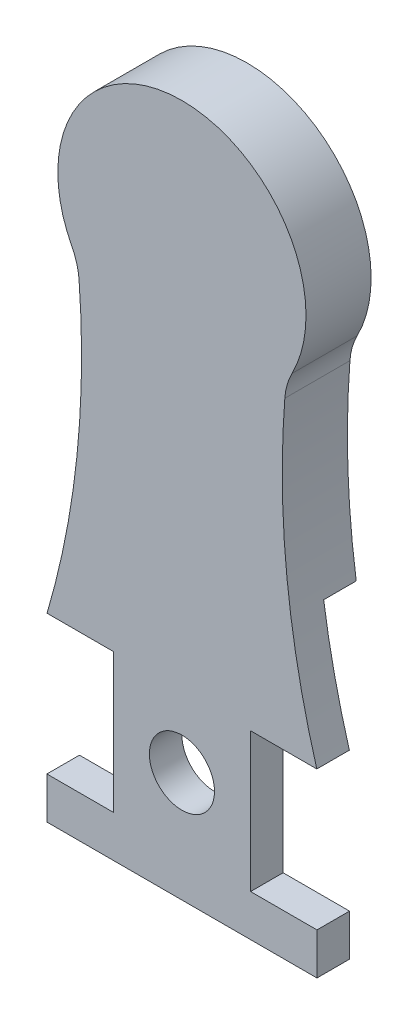
ISO-10303-21;
HEADER;
FILE_DESCRIPTION(('STEP AP214'),'2;1');
FILE_NAME('part.step','',(''),(''),'','','');
FILE_SCHEMA(('AUTOMOTIVE_DESIGN { 1 0 10303 214 1 1 1 1 }'));
ENDSEC;
DATA;
#1=APPLICATION_CONTEXT('core data for automotive mechanical design processes');
#2=APPLICATION_PROTOCOL_DEFINITION('international standard','automotive_design',2000,#1);
#3=PRODUCT_CONTEXT('',#1,'mechanical');
#4=PRODUCT('Part','Part','',(#3));
#5=PRODUCT_RELATED_PRODUCT_CATEGORY('part','',(#4));
#6=PRODUCT_DEFINITION_FORMATION('','',#4);
#7=PRODUCT_DEFINITION_CONTEXT('part definition',#1,'design');
#8=PRODUCT_DEFINITION('design','',#6,#7);
#9=PRODUCT_DEFINITION_SHAPE('','',#8);
#10=(LENGTH_UNIT() NAMED_UNIT(*) SI_UNIT(.MILLI.,.METRE.));
#11=(NAMED_UNIT(*) PLANE_ANGLE_UNIT() SI_UNIT($,.RADIAN.));
#12=(NAMED_UNIT(*) SI_UNIT($,.STERADIAN.) SOLID_ANGLE_UNIT());
#13=UNCERTAINTY_MEASURE_WITH_UNIT(LENGTH_MEASURE(1.E-05),#10,'distance_accuracy_value','');
#14=(GEOMETRIC_REPRESENTATION_CONTEXT(3) GLOBAL_UNCERTAINTY_ASSIGNED_CONTEXT((#13)) GLOBAL_UNIT_ASSIGNED_CONTEXT((#10,
#11,#12)) REPRESENTATION_CONTEXT('',''));
#15=CARTESIAN_POINT('',(0.,0.,0.));
#16=DIRECTION('',(0.,0.,1.));
#17=DIRECTION('',(1.,0.,0.));
#18=AXIS2_PLACEMENT_3D('',#15,#16,#17);
#19=CARTESIAN_POINT('',(0.,0.,0.));
#20=DIRECTION('',(0.,0.,1.));
#21=DIRECTION('',(1.,0.,0.));
#22=AXIS2_PLACEMENT_3D('',#19,#20,#21);
#23=CYLINDRICAL_SURFACE('',#22,5.);
#24=CARTESIAN_POINT('',(0.,0.,10.));
#25=DIRECTION('',(0.,0.,1.));
#26=DIRECTION('',(1.,0.,0.));
#27=AXIS2_PLACEMENT_3D('',#24,#25,#26);
#28=CIRCLE('',#27,5.);
#29=CARTESIAN_POINT('',(5.,0.,10.));
#30=VERTEX_POINT('',#29);
#31=EDGE_CURVE('E183',#30,#30,#28,.T.);
#32=ORIENTED_EDGE('',*,*,#31,.T.);
#33=EDGE_LOOP('',(#32));
#34=FACE_BOUND('',#33,.T.);
#35=CARTESIAN_POINT('',(0.,0.,5.));
#36=DIRECTION('',(0.,0.,-1.));
#37=DIRECTION('',(-1.,0.,0.));
#38=AXIS2_PLACEMENT_3D('',#35,#36,#37);
#39=CIRCLE('',#38,5.);
#40=CARTESIAN_POINT('',(-5.,0.,5.));
#41=VERTEX_POINT('',#40);
#42=EDGE_CURVE('E232',#41,#41,#39,.F.);
#43=ORIENTED_EDGE('',*,*,#42,.F.);
#44=EDGE_LOOP('',(#43));
#45=FACE_BOUND('',#44,.T.);
#46=ADVANCED_FACE('F32',(#34,#45),#23,.F.);
#47=CARTESIAN_POINT('',(-20.9931970741549,10.845815,0.));
#48=DIRECTION('',(0.,1.,0.));
#49=DIRECTION('',(0.,0.,1.));
#50=AXIS2_PLACEMENT_3D('',#47,#48,#49);
#51=PLANE('',#50);
#52=DIRECTION('',(-1.,0.,0.));
#53=VECTOR('',#52,1.);
#54=CARTESIAN_POINT('',(-20.9931970741549,10.845815,5.));
#55=LINE('',#54,#53);
#56=CARTESIAN_POINT('',(-10.542895,10.845815,5.));
#57=VERTEX_POINT('',#56);
#58=CARTESIAN_POINT('',(-20.7164128775921,10.845815,5.));
#59=VERTEX_POINT('',#58);
#60=EDGE_CURVE('E300',#57,#59,#55,.T.);
#61=ORIENTED_EDGE('',*,*,#60,.F.);
#62=DIRECTION('',(0.,0.,1.));
#63=VECTOR('',#62,1.);
#64=CARTESIAN_POINT('',(-10.542895,10.845815,0.));
#65=LINE('',#64,#63);
#66=CARTESIAN_POINT('',(-10.542895,10.845815,10.));
#67=VERTEX_POINT('',#66);
#68=EDGE_CURVE('E180',#57,#67,#65,.T.);
#69=ORIENTED_EDGE('',*,*,#68,.T.);
#70=DIRECTION('',(-1.,0.,0.));
#71=VECTOR('',#70,1.);
#72=CARTESIAN_POINT('',(-20.9931970741549,10.845815,10.));
#73=LINE('',#72,#71);
#74=CARTESIAN_POINT('',(-20.7164128775921,10.845815,10.));
#75=VERTEX_POINT('',#74);
#76=EDGE_CURVE('E172',#67,#75,#73,.T.);
#77=ORIENTED_EDGE('',*,*,#76,.T.);
#78=DIRECTION('',(0.,0.,-1.));
#79=VECTOR('',#78,1.);
#80=CARTESIAN_POINT('',(-20.7164128775921,10.845815,10.));
#81=LINE('',#80,#79);
#82=EDGE_CURVE('E179',#59,#75,#81,.F.);
#83=ORIENTED_EDGE('',*,*,#82,.F.);
#84=EDGE_LOOP('',(#61,#69,#77,#83));
#85=FACE_BOUND('',#84,.T.);
#86=ADVANCED_FACE('F323',(#85),#51,.F.);
#87=CARTESIAN_POINT('',(10.542895,10.845815,0.));
#88=DIRECTION('',(0.,1.,0.));
#89=DIRECTION('',(-1.,0.,0.));
#90=AXIS2_PLACEMENT_3D('',#87,#88,#89);
#91=PLANE('',#90);
#92=DIRECTION('',(-1.,0.,0.));
#93=VECTOR('',#92,1.);
#94=CARTESIAN_POINT('',(10.542895,10.845815,5.));
#95=LINE('',#94,#93);
#96=CARTESIAN_POINT('',(20.7164128775922,10.845815,5.));
#97=VERTEX_POINT('',#96);
#98=CARTESIAN_POINT('',(10.542895,10.845815,5.));
#99=VERTEX_POINT('',#98);
#100=EDGE_CURVE('E150',#97,#99,#95,.T.);
#101=ORIENTED_EDGE('',*,*,#100,.F.);
#102=DIRECTION('',(0.,0.,-1.));
#103=VECTOR('',#102,1.);
#104=CARTESIAN_POINT('',(20.7164128775922,10.845815,10.));
#105=LINE('',#104,#103);
#106=CARTESIAN_POINT('',(20.7164128775922,10.845815,10.));
#107=VERTEX_POINT('',#106);
#108=EDGE_CURVE('E176',#107,#97,#105,.T.);
#109=ORIENTED_EDGE('',*,*,#108,.F.);
#110=DIRECTION('',(-1.,0.,0.));
#111=VECTOR('',#110,1.);
#112=CARTESIAN_POINT('',(10.542895,10.845815,10.));
#113=LINE('',#112,#111);
#114=CARTESIAN_POINT('',(10.542895,10.845815,10.));
#115=VERTEX_POINT('',#114);
#116=EDGE_CURVE('E243',#107,#115,#113,.T.);
#117=ORIENTED_EDGE('',*,*,#116,.T.);
#118=DIRECTION('',(0.,0.,1.));
#119=VECTOR('',#118,1.);
#120=CARTESIAN_POINT('',(10.542895,10.845815,0.));
#121=LINE('',#120,#119);
#122=EDGE_CURVE('E168',#99,#115,#121,.T.);
#123=ORIENTED_EDGE('',*,*,#122,.F.);
#124=EDGE_LOOP('',(#101,#109,#117,#123));
#125=FACE_BOUND('',#124,.T.);
#126=ADVANCED_FACE('F311',(#125),#91,.F.);
#127=CARTESIAN_POINT('',(-10.542895,10.845815,0.));
#128=DIRECTION('',(1.,0.,0.));
#129=DIRECTION('',(0.,1.,0.));
#130=AXIS2_PLACEMENT_3D('',#127,#128,#129);
#131=PLANE('',#130);
#132=DIRECTION('',(0.,1.,0.));
#133=VECTOR('',#132,1.);
#134=CARTESIAN_POINT('',(-10.542895,10.845815,5.));
#135=LINE('',#134,#133);
#136=CARTESIAN_POINT('',(-10.542895,-10.5428949999999,5.));
#137=VERTEX_POINT('',#136);
#138=EDGE_CURVE('E295',#137,#57,#135,.T.);
#139=ORIENTED_EDGE('',*,*,#138,.F.);
#140=DIRECTION('',(0.,0.,1.));
#141=VECTOR('',#140,1.);
#142=CARTESIAN_POINT('',(-10.542895,-10.5428949999999,0.));
#143=LINE('',#142,#141);
#144=CARTESIAN_POINT('',(-10.542895,-10.5428949999999,10.));
#145=VERTEX_POINT('',#144);
#146=EDGE_CURVE('E267',#137,#145,#143,.T.);
#147=ORIENTED_EDGE('',*,*,#146,.T.);
#148=DIRECTION('',(0.,1.,0.));
#149=VECTOR('',#148,1.);
#150=CARTESIAN_POINT('',(-10.542895,10.845815,10.));
#151=LINE('',#150,#149);
#152=EDGE_CURVE('E261',#145,#67,#151,.T.);
#153=ORIENTED_EDGE('',*,*,#152,.T.);
#154=ORIENTED_EDGE('',*,*,#68,.F.);
#155=EDGE_LOOP('',(#139,#147,#153,#154));
#156=FACE_BOUND('',#155,.T.);
#157=ADVANCED_FACE('F363',(#156),#131,.F.);
#158=CARTESIAN_POINT('',(-10.542895,-10.5428949999999,0.));
#159=DIRECTION('',(0.,-1.,0.));
#160=DIRECTION('',(0.,0.,-1.));
#161=AXIS2_PLACEMENT_3D('',#158,#159,#160);
#162=PLANE('',#161);
#163=DIRECTION('',(1.,0.,0.));
#164=VECTOR('',#163,1.);
#165=CARTESIAN_POINT('',(-10.542895,-10.5428949999999,5.));
#166=LINE('',#165,#164);
#167=CARTESIAN_POINT('',(-20.741205,-10.5428949999999,5.));
#168=VERTEX_POINT('',#167);
#169=EDGE_CURVE('E293',#168,#137,#166,.T.);
#170=ORIENTED_EDGE('',*,*,#169,.F.);
#171=DIRECTION('',(0.,0.,1.));
#172=VECTOR('',#171,1.);
#173=CARTESIAN_POINT('',(-20.741205,-10.5428949999999,0.));
#174=LINE('',#173,#172);
#175=CARTESIAN_POINT('',(-20.741205,-10.5428949999999,10.));
#176=VERTEX_POINT('',#175);
#177=EDGE_CURVE('E269',#168,#176,#174,.T.);
#178=ORIENTED_EDGE('',*,*,#177,.T.);
#179=DIRECTION('',(1.,0.,0.));
#180=VECTOR('',#179,1.);
#181=CARTESIAN_POINT('',(-10.542895,-10.5428949999999,10.));
#182=LINE('',#181,#180);
#183=EDGE_CURVE('E258',#176,#145,#182,.T.);
#184=ORIENTED_EDGE('',*,*,#183,.T.);
#185=ORIENTED_EDGE('',*,*,#146,.F.);
#186=EDGE_LOOP('',(#170,#178,#184,#185));
#187=FACE_BOUND('',#186,.T.);
#188=ADVANCED_FACE('F360',(#187),#162,.F.);
#189=CARTESIAN_POINT('',(-20.741205,-10.5428949999999,0.));
#190=DIRECTION('',(1.,0.,0.));
#191=DIRECTION('',(0.,1.,0.));
#192=AXIS2_PLACEMENT_3D('',#189,#190,#191);
#193=PLANE('',#192);
#194=DIRECTION('',(0.,1.,0.));
#195=VECTOR('',#194,1.);
#196=CARTESIAN_POINT('',(-20.741205,-10.5428949999999,5.));
#197=LINE('',#196,#195);
#198=CARTESIAN_POINT('',(-20.741205,-16.942445,5.));
#199=VERTEX_POINT('',#198);
#200=EDGE_CURVE('E291',#199,#168,#197,.T.);
#201=ORIENTED_EDGE('',*,*,#200,.F.);
#202=DIRECTION('',(0.,0.,1.));
#203=VECTOR('',#202,1.);
#204=CARTESIAN_POINT('',(-20.741205,-16.942445,0.));
#205=LINE('',#204,#203);
#206=CARTESIAN_POINT('',(-20.741205,-16.942445,10.));
#207=VERTEX_POINT('',#206);
#208=EDGE_CURVE('E271',#199,#207,#205,.T.);
#209=ORIENTED_EDGE('',*,*,#208,.T.);
#210=DIRECTION('',(0.,1.,0.));
#211=VECTOR('',#210,1.);
#212=CARTESIAN_POINT('',(-20.741205,-10.5428949999999,10.));
#213=LINE('',#212,#211);
#214=EDGE_CURVE('E255',#207,#176,#213,.T.);
#215=ORIENTED_EDGE('',*,*,#214,.T.);
#216=ORIENTED_EDGE('',*,*,#177,.F.);
#217=EDGE_LOOP('',(#201,#209,#215,#216));
#218=FACE_BOUND('',#217,.T.);
#219=ADVANCED_FACE('F290',(#218),#193,.F.);
#220=CARTESIAN_POINT('',(-20.741205,-16.942445,0.));
#221=DIRECTION('',(0.,1.,0.));
#222=DIRECTION('',(-1.,0.,0.));
#223=AXIS2_PLACEMENT_3D('',#220,#221,#222);
#224=PLANE('',#223);
#225=DIRECTION('',(-1.,0.,0.));
#226=VECTOR('',#225,1.);
#227=CARTESIAN_POINT('',(-20.741205,-16.942445,5.));
#228=LINE('',#227,#226);
#229=CARTESIAN_POINT('',(20.741205,-16.9424449999999,5.));
#230=VERTEX_POINT('',#229);
#231=EDGE_CURVE('E279',#230,#199,#228,.T.);
#232=ORIENTED_EDGE('',*,*,#231,.F.);
#233=DIRECTION('',(0.,0.,1.));
#234=VECTOR('',#233,1.);
#235=CARTESIAN_POINT('',(20.741205,-16.9424449999999,0.));
#236=LINE('',#235,#234);
#237=CARTESIAN_POINT('',(20.741205,-16.9424449999999,10.));
#238=VERTEX_POINT('',#237);
#239=EDGE_CURVE('E170',#230,#238,#236,.T.);
#240=ORIENTED_EDGE('',*,*,#239,.T.);
#241=DIRECTION('',(-1.,0.,0.));
#242=VECTOR('',#241,1.);
#243=CARTESIAN_POINT('',(-20.741205,-16.942445,10.));
#244=LINE('',#243,#242);
#245=EDGE_CURVE('E252',#238,#207,#244,.T.);
#246=ORIENTED_EDGE('',*,*,#245,.T.);
#247=ORIENTED_EDGE('',*,*,#208,.F.);
#248=EDGE_LOOP('',(#232,#240,#246,#247));
#249=FACE_BOUND('',#248,.T.);
#250=ADVANCED_FACE('F275',(#249),#224,.F.);
#251=CARTESIAN_POINT('',(20.741205,-16.9424449999999,0.));
#252=DIRECTION('',(-1.,0.,0.));
#253=DIRECTION('',(0.,-1.,0.));
#254=AXIS2_PLACEMENT_3D('',#251,#252,#253);
#255=PLANE('',#254);
#256=DIRECTION('',(0.,-1.,0.));
#257=VECTOR('',#256,1.);
#258=CARTESIAN_POINT('',(20.741205,-16.9424449999999,5.));
#259=LINE('',#258,#257);
#260=CARTESIAN_POINT('',(20.741205,-10.5428949999999,5.));
#261=VERTEX_POINT('',#260);
#262=EDGE_CURVE('E162',#261,#230,#259,.T.);
#263=ORIENTED_EDGE('',*,*,#262,.F.);
#264=DIRECTION('',(0.,0.,1.));
#265=VECTOR('',#264,1.);
#266=CARTESIAN_POINT('',(20.741205,-10.5428949999999,0.));
#267=LINE('',#266,#265);
#268=CARTESIAN_POINT('',(20.741205,-10.5428949999999,10.));
#269=VERTEX_POINT('',#268);
#270=EDGE_CURVE('E161',#261,#269,#267,.T.);
#271=ORIENTED_EDGE('',*,*,#270,.T.);
#272=DIRECTION('',(0.,-1.,0.));
#273=VECTOR('',#272,1.);
#274=CARTESIAN_POINT('',(20.741205,-16.9424449999999,10.));
#275=LINE('',#274,#273);
#276=EDGE_CURVE('E249',#269,#238,#275,.T.);
#277=ORIENTED_EDGE('',*,*,#276,.T.);
#278=ORIENTED_EDGE('',*,*,#239,.F.);
#279=EDGE_LOOP('',(#263,#271,#277,#278));
#280=FACE_BOUND('',#279,.T.);
#281=ADVANCED_FACE('F282',(#280),#255,.F.);
#282=CARTESIAN_POINT('',(20.741205,-10.5428949999999,0.));
#283=DIRECTION('',(0.,-1.,0.));
#284=DIRECTION('',(0.,0.,-1.));
#285=AXIS2_PLACEMENT_3D('',#282,#283,#284);
#286=PLANE('',#285);
#287=DIRECTION('',(1.,0.,0.));
#288=VECTOR('',#287,1.);
#289=CARTESIAN_POINT('',(20.741205,-10.5428949999999,5.));
#290=LINE('',#289,#288);
#291=CARTESIAN_POINT('',(10.542895,-10.5428949999999,5.));
#292=VERTEX_POINT('',#291);
#293=EDGE_CURVE('E147',#292,#261,#290,.T.);
#294=ORIENTED_EDGE('',*,*,#293,.F.);
#295=DIRECTION('',(0.,0.,1.));
#296=VECTOR('',#295,1.);
#297=CARTESIAN_POINT('',(10.542895,-10.5428949999999,0.));
#298=LINE('',#297,#296);
#299=CARTESIAN_POINT('',(10.542895,-10.5428949999999,10.));
#300=VERTEX_POINT('',#299);
#301=EDGE_CURVE('E159',#292,#300,#298,.T.);
#302=ORIENTED_EDGE('',*,*,#301,.T.);
#303=DIRECTION('',(1.,0.,0.));
#304=VECTOR('',#303,1.);
#305=CARTESIAN_POINT('',(20.741205,-10.5428949999999,10.));
#306=LINE('',#305,#304);
#307=EDGE_CURVE('E247',#300,#269,#306,.T.);
#308=ORIENTED_EDGE('',*,*,#307,.T.);
#309=ORIENTED_EDGE('',*,*,#270,.F.);
#310=EDGE_LOOP('',(#294,#302,#308,#309));
#311=FACE_BOUND('',#310,.T.);
#312=ADVANCED_FACE('F157',(#311),#286,.F.);
#313=CARTESIAN_POINT('',(10.542895,-10.5428949999999,0.));
#314=DIRECTION('',(-1.,0.,0.));
#315=DIRECTION('',(0.,-1.,0.));
#316=AXIS2_PLACEMENT_3D('',#313,#314,#315);
#317=PLANE('',#316);
#318=DIRECTION('',(0.,-1.,0.));
#319=VECTOR('',#318,1.);
#320=CARTESIAN_POINT('',(10.542895,-10.5428949999999,5.));
#321=LINE('',#320,#319);
#322=EDGE_CURVE('E144',#99,#292,#321,.T.);
#323=ORIENTED_EDGE('',*,*,#322,.F.);
#324=ORIENTED_EDGE('',*,*,#122,.T.);
#325=DIRECTION('',(0.,-1.,0.));
#326=VECTOR('',#325,1.);
#327=CARTESIAN_POINT('',(10.542895,-10.5428949999999,10.));
#328=LINE('',#327,#326);
#329=EDGE_CURVE('E166',#115,#300,#328,.T.);
#330=ORIENTED_EDGE('',*,*,#329,.T.);
#331=ORIENTED_EDGE('',*,*,#301,.F.);
#332=EDGE_LOOP('',(#323,#324,#330,#331));
#333=FACE_BOUND('',#332,.T.);
#334=ADVANCED_FACE('F164',(#333),#317,.F.);
#335=CARTESIAN_POINT('',(0.,70.3553754448398,10.));
#336=DIRECTION('',(0.,0.,-1.));
#337=DIRECTION('',(-1.,0.,0.));
#338=AXIS2_PLACEMENT_3D('',#335,#336,#337);
#339=CYLINDRICAL_SURFACE('',#338,19.0586935702212);
#340=CARTESIAN_POINT('',(0.,70.3553754448398,0.));
#341=DIRECTION('',(0.,0.,1.));
#342=DIRECTION('',(-1.,0.,0.));
#343=AXIS2_PLACEMENT_3D('',#340,#341,#342);
#344=CIRCLE('',#343,19.0586935702212);
#345=CARTESIAN_POINT('',(16.9028870826974,61.5504785758713,0.));
#346=VERTEX_POINT('',#345);
#347=CARTESIAN_POINT('',(-16.9028870826973,61.5504785758711,0.));
#348=VERTEX_POINT('',#347);
#349=EDGE_CURVE('E186',#346,#348,#344,.T.);
#350=ORIENTED_EDGE('',*,*,#349,.T.);
#351=DIRECTION('',(0.,0.,-1.));
#352=VECTOR('',#351,1.);
#353=CARTESIAN_POINT('',(-16.9028870826973,61.5504785758711,10.));
#354=LINE('',#353,#352);
#355=CARTESIAN_POINT('',(-16.9028870826973,61.5504785758711,10.));
#356=VERTEX_POINT('',#355);
#357=EDGE_CURVE('E53',#348,#356,#354,.F.);
#358=ORIENTED_EDGE('',*,*,#357,.T.);
#359=CARTESIAN_POINT('',(0.,70.3553754448398,10.));
#360=DIRECTION('',(0.,0.,1.));
#361=DIRECTION('',(-1.,0.,0.));
#362=AXIS2_PLACEMENT_3D('',#359,#360,#361);
#363=CIRCLE('',#362,19.0586935702212);
#364=CARTESIAN_POINT('',(16.9028870826974,61.5504785758713,10.));
#365=VERTEX_POINT('',#364);
#366=EDGE_CURVE('E187',#365,#356,#363,.T.);
#367=ORIENTED_EDGE('',*,*,#366,.F.);
#368=DIRECTION('',(0.,0.,-1.));
#369=VECTOR('',#368,1.);
#370=CARTESIAN_POINT('',(16.9028870826974,61.5504785758713,10.));
#371=LINE('',#370,#369);
#372=EDGE_CURVE('E195',#365,#346,#371,.T.);
#373=ORIENTED_EDGE('',*,*,#372,.T.);
#374=EDGE_LOOP('',(#350,#358,#367,#373));
#375=FACE_BOUND('',#374,.T.);
#376=ADVANCED_FACE('F317',(#375),#339,.T.);
#377=CARTESIAN_POINT('',(-145.699843401506,47.6415158733175,10.));
#378=DIRECTION('',(0.,0.,-1.));
#379=DIRECTION('',(-1.,0.,0.));
#380=AXIS2_PLACEMENT_3D('',#377,#378,#379);
#381=CYLINDRICAL_SURFACE('',#380,130.287303711009);
#382=CARTESIAN_POINT('',(-145.699843401506,47.6415158733175,10.));
#383=DIRECTION('',(0.,0.,-1.));
#384=DIRECTION('',(1.,0.,0.));
#385=AXIS2_PLACEMENT_3D('',#382,#383,#384);
#386=CIRCLE('',#385,130.287303711009);
#387=CARTESIAN_POINT('',(-15.8016087267101,57.7028347061713,10.));
#388=VERTEX_POINT('',#387);
#389=EDGE_CURVE('E189',#388,#75,#386,.T.);
#390=ORIENTED_EDGE('',*,*,#389,.F.);
#391=DIRECTION('',(0.,0.,-1.));
#392=VECTOR('',#391,1.);
#393=CARTESIAN_POINT('',(-15.8016087267101,57.7028347061713,10.));
#394=LINE('',#393,#392);
#395=CARTESIAN_POINT('',(-15.8016087267101,57.7028347061713,0.));
#396=VERTEX_POINT('',#395);
#397=EDGE_CURVE('E209',#388,#396,#394,.T.);
#398=ORIENTED_EDGE('',*,*,#397,.T.);
#399=CARTESIAN_POINT('',(-145.699843401506,47.6415158733175,0.));
#400=DIRECTION('',(0.,0.,-1.));
#401=DIRECTION('',(1.,0.,0.));
#402=AXIS2_PLACEMENT_3D('',#399,#400,#401);
#403=CIRCLE('',#402,130.287303711009);
#404=CARTESIAN_POINT('',(-16.770012649557,28.8830444388301,0.));
#405=VERTEX_POINT('',#404);
#406=EDGE_CURVE('E197',#396,#405,#403,.T.);
#407=ORIENTED_EDGE('',*,*,#406,.T.);
#408=DIRECTION('',(0.,0.,-1.));
#409=VECTOR('',#408,1.);
#410=CARTESIAN_POINT('',(-16.770012649557,28.8830444388301,2.5));
#411=LINE('',#410,#409);
#412=CARTESIAN_POINT('',(-16.7700126495571,28.88304443883,5.));
#413=VERTEX_POINT('',#412);
#414=EDGE_CURVE('E241',#405,#413,#411,.F.);
#415=ORIENTED_EDGE('',*,*,#414,.T.);
#416=CARTESIAN_POINT('',(-145.699843401506,47.6415158733175,5.));
#417=DIRECTION('',(0.,0.,-1.));
#418=DIRECTION('',(-1.,0.,0.));
#419=AXIS2_PLACEMENT_3D('',#416,#417,#418);
#420=CIRCLE('',#419,130.287303711009);
#421=EDGE_CURVE('E237',#59,#413,#420,.F.);
#422=ORIENTED_EDGE('',*,*,#421,.F.);
#423=ORIENTED_EDGE('',*,*,#82,.T.);
#424=EDGE_LOOP('',(#390,#398,#407,#415,#422,#423));
#425=FACE_BOUND('',#424,.T.);
#426=ADVANCED_FACE('F215',(#425),#381,.F.);
#427=CARTESIAN_POINT('',(145.699843401506,47.6415158733176,10.));
#428=DIRECTION('',(0.,0.,-1.));
#429=DIRECTION('',(-1.,0.,0.));
#430=AXIS2_PLACEMENT_3D('',#427,#428,#429);
#431=CYLINDRICAL_SURFACE('',#430,130.287303711009);
#432=CARTESIAN_POINT('',(145.699843401506,47.6415158733176,0.));
#433=DIRECTION('',(0.,0.,-1.));
#434=DIRECTION('',(-1.,0.,0.));
#435=AXIS2_PLACEMENT_3D('',#432,#433,#434);
#436=CIRCLE('',#435,130.287303711009);
#437=CARTESIAN_POINT('',(16.7700126495573,28.8830444388298,0.));
#438=VERTEX_POINT('',#437);
#439=CARTESIAN_POINT('',(15.8016087267103,57.7028347061717,0.));
#440=VERTEX_POINT('',#439);
#441=EDGE_CURVE('E190',#438,#440,#436,.T.);
#442=ORIENTED_EDGE('',*,*,#441,.T.);
#443=DIRECTION('',(0.,0.,-1.));
#444=VECTOR('',#443,1.);
#445=CARTESIAN_POINT('',(15.8016087267103,57.7028347061717,10.));
#446=LINE('',#445,#444);
#447=CARTESIAN_POINT('',(15.8016087267103,57.7028347061717,10.));
#448=VERTEX_POINT('',#447);
#449=EDGE_CURVE('E203',#440,#448,#446,.F.);
#450=ORIENTED_EDGE('',*,*,#449,.T.);
#451=CARTESIAN_POINT('',(145.699843401506,47.6415158733176,10.));
#452=DIRECTION('',(0.,0.,-1.));
#453=DIRECTION('',(-1.,0.,0.));
#454=AXIS2_PLACEMENT_3D('',#451,#452,#453);
#455=CIRCLE('',#454,130.287303711009);
#456=EDGE_CURVE('E192',#107,#448,#455,.T.);
#457=ORIENTED_EDGE('',*,*,#456,.F.);
#458=ORIENTED_EDGE('',*,*,#108,.T.);
#459=CARTESIAN_POINT('',(145.699843401506,47.6415158733176,5.));
#460=DIRECTION('',(0.,0.,-1.));
#461=DIRECTION('',(-1.,0.,0.));
#462=AXIS2_PLACEMENT_3D('',#459,#460,#461);
#463=CIRCLE('',#462,130.287303711009);
#464=CARTESIAN_POINT('',(16.7700126495573,28.8830444388298,5.));
#465=VERTEX_POINT('',#464);
#466=EDGE_CURVE('E235',#465,#97,#463,.F.);
#467=ORIENTED_EDGE('',*,*,#466,.F.);
#468=DIRECTION('',(0.,0.,-1.));
#469=VECTOR('',#468,1.);
#470=CARTESIAN_POINT('',(16.7700126495573,28.8830444388298,2.5));
#471=LINE('',#470,#469);
#472=EDGE_CURVE('E239',#465,#438,#471,.T.);
#473=ORIENTED_EDGE('',*,*,#472,.T.);
#474=EDGE_LOOP('',(#442,#450,#457,#458,#467,#473));
#475=FACE_BOUND('',#474,.T.);
#476=ADVANCED_FACE('F307',(#475),#431,.F.);
#477=CARTESIAN_POINT('',(72.8499217007529,58.9984456590787,10.));
#478=DIRECTION('',(0.,0.,-1.));
#479=DIRECTION('',(-1.,0.,0.));
#480=AXIS2_PLACEMENT_3D('',#477,#478,#479);
#481=PLANE('',#480);
#482=ORIENTED_EDGE('',*,*,#31,.F.);
#483=EDGE_LOOP('',(#482));
#484=FACE_BOUND('',#483,.T.);
#485=ORIENTED_EDGE('',*,*,#366,.T.);
#486=CARTESIAN_POINT('',(-25.771746336045,56.9305937781396,10.));
#487=DIRECTION('',(0.,0.,-1.));
#488=DIRECTION('',(-1.,0.,0.));
#489=AXIS2_PLACEMENT_3D('',#486,#487,#488);
#490=CIRCLE('',#489,10.);
#491=EDGE_CURVE('E11',#356,#388,#490,.T.);
#492=ORIENTED_EDGE('',*,*,#491,.T.);
#493=ORIENTED_EDGE('',*,*,#389,.T.);
#494=ORIENTED_EDGE('',*,*,#76,.F.);
#495=ORIENTED_EDGE('',*,*,#152,.F.);
#496=ORIENTED_EDGE('',*,*,#183,.F.);
#497=ORIENTED_EDGE('',*,*,#214,.F.);
#498=ORIENTED_EDGE('',*,*,#245,.F.);
#499=ORIENTED_EDGE('',*,*,#276,.F.);
#500=ORIENTED_EDGE('',*,*,#307,.F.);
#501=ORIENTED_EDGE('',*,*,#329,.F.);
#502=ORIENTED_EDGE('',*,*,#116,.F.);
#503=ORIENTED_EDGE('',*,*,#456,.T.);
#504=CARTESIAN_POINT('',(25.7717463360451,56.93059377814,10.));
#505=DIRECTION('',(0.,0.,-1.));
#506=DIRECTION('',(-1.,0.,0.));
#507=AXIS2_PLACEMENT_3D('',#504,#505,#506);
#508=CIRCLE('',#507,10.);
#509=EDGE_CURVE('E207',#448,#365,#508,.T.);
#510=ORIENTED_EDGE('',*,*,#509,.T.);
#511=EDGE_LOOP('',(#485,#492,#493,#494,#495,#496,#497,#498,#499,#500,#501,#502,#503,#510));
#512=FACE_BOUND('',#511,.T.);
#513=ADVANCED_FACE('F284',(#484,#512),#481,.F.);
#514=CARTESIAN_POINT('',(72.8499217007529,58.9984456590787,0.));
#515=DIRECTION('',(0.,0.,-1.));
#516=DIRECTION('',(-1.,0.,0.));
#517=AXIS2_PLACEMENT_3D('',#514,#515,#516);
#518=PLANE('',#517);
#519=CARTESIAN_POINT('',(0.,14.6091297310939,0.));
#520=DIRECTION('',(0.,0.,-1.));
#521=DIRECTION('',(1.,0.,0.));
#522=AXIS2_PLACEMENT_3D('',#519,#520,#521);
#523=CIRCLE('',#522,22.0222152689058);
#524=EDGE_CURVE('E223',#405,#438,#523,.T.);
#525=ORIENTED_EDGE('',*,*,#524,.F.);
#526=ORIENTED_EDGE('',*,*,#406,.F.);
#527=CARTESIAN_POINT('',(-25.771746336045,56.9305937781396,0.));
#528=DIRECTION('',(0.,0.,-1.));
#529=DIRECTION('',(-1.,0.,0.));
#530=AXIS2_PLACEMENT_3D('',#527,#528,#529);
#531=CIRCLE('',#530,10.);
#532=EDGE_CURVE('E40',#396,#348,#531,.F.);
#533=ORIENTED_EDGE('',*,*,#532,.T.);
#534=ORIENTED_EDGE('',*,*,#349,.F.);
#535=CARTESIAN_POINT('',(25.7717463360451,56.93059377814,0.));
#536=DIRECTION('',(0.,0.,-1.));
#537=DIRECTION('',(-1.,0.,0.));
#538=AXIS2_PLACEMENT_3D('',#535,#536,#537);
#539=CIRCLE('',#538,10.);
#540=EDGE_CURVE('E205',#346,#440,#539,.F.);
#541=ORIENTED_EDGE('',*,*,#540,.T.);
#542=ORIENTED_EDGE('',*,*,#441,.F.);
#543=EDGE_LOOP('',(#525,#526,#533,#534,#541,#542));
#544=FACE_BOUND('',#543,.T.);
#545=ADVANCED_FACE('F221',(#544),#518,.T.);
#546=CARTESIAN_POINT('',(0.,14.6091297310939,5.));
#547=DIRECTION('',(0.,0.,-1.));
#548=DIRECTION('',(-1.,0.,0.));
#549=AXIS2_PLACEMENT_3D('',#546,#547,#548);
#550=CYLINDRICAL_SURFACE('',#549,22.0222152689058);
#551=ORIENTED_EDGE('',*,*,#524,.T.);
#552=ORIENTED_EDGE('',*,*,#472,.F.);
#553=CARTESIAN_POINT('',(0.,14.6091297310939,5.));
#554=DIRECTION('',(0.,0.,-1.));
#555=DIRECTION('',(1.,0.,0.));
#556=AXIS2_PLACEMENT_3D('',#553,#554,#555);
#557=CIRCLE('',#556,22.0222152689058);
#558=EDGE_CURVE('E230',#413,#465,#557,.T.);
#559=ORIENTED_EDGE('',*,*,#558,.F.);
#560=ORIENTED_EDGE('',*,*,#414,.F.);
#561=EDGE_LOOP('',(#551,#552,#559,#560));
#562=FACE_BOUND('',#561,.T.);
#563=ADVANCED_FACE('F340',(#562),#550,.F.);
#564=CARTESIAN_POINT('',(178.744699462036,56.6532052908394,5.));
#565=DIRECTION('',(0.,0.,-1.));
#566=DIRECTION('',(-1.,0.,0.));
#567=AXIS2_PLACEMENT_3D('',#564,#565,#566);
#568=PLANE('',#567);
#569=ORIENTED_EDGE('',*,*,#42,.T.);
#570=EDGE_LOOP('',(#569));
#571=FACE_BOUND('',#570,.T.);
#572=ORIENTED_EDGE('',*,*,#421,.T.);
#573=ORIENTED_EDGE('',*,*,#558,.T.);
#574=ORIENTED_EDGE('',*,*,#466,.T.);
#575=ORIENTED_EDGE('',*,*,#100,.T.);
#576=ORIENTED_EDGE('',*,*,#322,.T.);
#577=ORIENTED_EDGE('',*,*,#293,.T.);
#578=ORIENTED_EDGE('',*,*,#262,.T.);
#579=ORIENTED_EDGE('',*,*,#231,.T.);
#580=ORIENTED_EDGE('',*,*,#200,.T.);
#581=ORIENTED_EDGE('',*,*,#169,.T.);
#582=ORIENTED_EDGE('',*,*,#138,.T.);
#583=ORIENTED_EDGE('',*,*,#60,.T.);
#584=EDGE_LOOP('',(#572,#573,#574,#575,#576,#577,#578,#579,#580,#581,#582,#583));
#585=FACE_BOUND('',#584,.T.);
#586=ADVANCED_FACE('F146',(#571,#585),#568,.T.);
#587=CARTESIAN_POINT('',(25.7717463360451,56.93059377814,10.));
#588=DIRECTION('',(0.,0.,-1.));
#589=DIRECTION('',(-1.,0.,0.));
#590=AXIS2_PLACEMENT_3D('',#587,#588,#589);
#591=CYLINDRICAL_SURFACE('',#590,10.);
#592=ORIENTED_EDGE('',*,*,#509,.F.);
#593=ORIENTED_EDGE('',*,*,#449,.F.);
#594=ORIENTED_EDGE('',*,*,#540,.F.);
#595=ORIENTED_EDGE('',*,*,#372,.F.);
#596=EDGE_LOOP('',(#592,#593,#594,#595));
#597=FACE_BOUND('',#596,.T.);
#598=ADVANCED_FACE('F316',(#597),#591,.F.);
#599=CARTESIAN_POINT('',(-25.771746336045,56.9305937781396,10.));
#600=DIRECTION('',(0.,0.,-1.));
#601=DIRECTION('',(-1.,0.,0.));
#602=AXIS2_PLACEMENT_3D('',#599,#600,#601);
#603=CYLINDRICAL_SURFACE('',#602,10.);
#604=ORIENTED_EDGE('',*,*,#491,.F.);
#605=ORIENTED_EDGE('',*,*,#357,.F.);
#606=ORIENTED_EDGE('',*,*,#532,.F.);
#607=ORIENTED_EDGE('',*,*,#397,.F.);
#608=EDGE_LOOP('',(#604,#605,#606,#607));
#609=FACE_BOUND('',#608,.T.);
#610=ADVANCED_FACE('F34',(#609),#603,.F.);
#611=CLOSED_SHELL('',(#46,#86,#126,#157,#188,#219,#250,#281,#312,#334,#376,#426,#476,#513,#545,
#563,#586,#598,#610));
#612=MANIFOLD_SOLID_BREP('B2',#611);
#613=ADVANCED_BREP_SHAPE_REPRESENTATION('',(#18,#612),#14);
#614=SHAPE_DEFINITION_REPRESENTATION(#9,#613);
ENDSEC;
END-ISO-10303-21;
